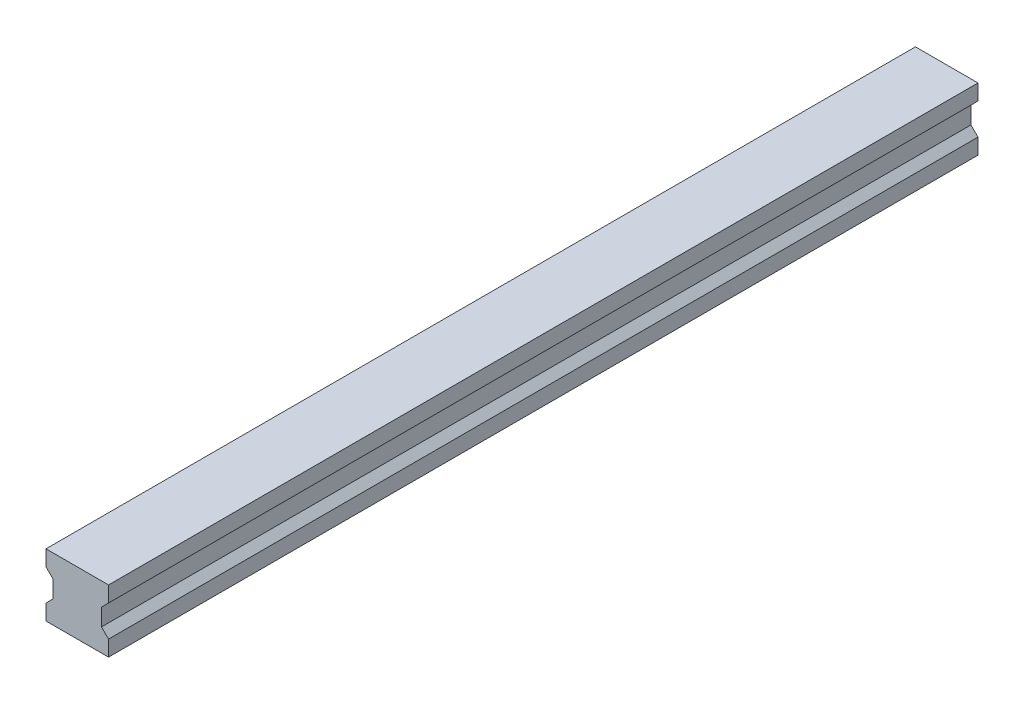
ISO-10303-21;
HEADER;
FILE_DESCRIPTION(('STEP AP214'),'2;1');
FILE_NAME('part.step','',(''),(''),'','','');
FILE_SCHEMA(('AUTOMOTIVE_DESIGN { 1 0 10303 214 1 1 1 1 }'));
ENDSEC;
DATA;
#1=APPLICATION_CONTEXT('core data for automotive mechanical design processes');
#2=APPLICATION_PROTOCOL_DEFINITION('international standard','automotive_design',2000,#1);
#3=PRODUCT_CONTEXT('',#1,'mechanical');
#4=PRODUCT('Part','Part','',(#3));
#5=PRODUCT_RELATED_PRODUCT_CATEGORY('part','',(#4));
#6=PRODUCT_DEFINITION_FORMATION('','',#4);
#7=PRODUCT_DEFINITION_CONTEXT('part definition',#1,'design');
#8=PRODUCT_DEFINITION('design','',#6,#7);
#9=PRODUCT_DEFINITION_SHAPE('','',#8);
#10=(LENGTH_UNIT() NAMED_UNIT(*) SI_UNIT(.MILLI.,.METRE.));
#11=(NAMED_UNIT(*) PLANE_ANGLE_UNIT() SI_UNIT($,.RADIAN.));
#12=(NAMED_UNIT(*) SI_UNIT($,.STERADIAN.) SOLID_ANGLE_UNIT());
#13=UNCERTAINTY_MEASURE_WITH_UNIT(LENGTH_MEASURE(1.E-05),#10,'distance_accuracy_value','');
#14=(GEOMETRIC_REPRESENTATION_CONTEXT(3) GLOBAL_UNCERTAINTY_ASSIGNED_CONTEXT((#13)) GLOBAL_UNIT_ASSIGNED_CONTEXT((#10,
#11,#12)) REPRESENTATION_CONTEXT('',''));
#15=CARTESIAN_POINT('',(0.,0.,0.));
#16=DIRECTION('',(0.,0.,1.));
#17=DIRECTION('',(1.,0.,0.));
#18=AXIS2_PLACEMENT_3D('',#15,#16,#17);
#19=CARTESIAN_POINT('',(10.,-5.,278.));
#20=DIRECTION('',(-0.707106781186552,-0.707106781186543,0.));
#21=DIRECTION('',(0.707106781186543,-0.707106781186552,0.));
#22=AXIS2_PLACEMENT_3D('',#19,#20,#21);
#23=PLANE('',#22);
#24=DIRECTION('',(-0.707106781186543,0.707106781186552,0.));
#25=VECTOR('',#24,1.);
#26=CARTESIAN_POINT('',(10.,-5.,0.));
#27=LINE('',#26,#25);
#28=CARTESIAN_POINT('',(10.,-5.,0.));
#29=VERTEX_POINT('',#28);
#30=CARTESIAN_POINT('',(7.75000000000003,-2.75,0.));
#31=VERTEX_POINT('',#30);
#32=EDGE_CURVE('E153',#29,#31,#27,.T.);
#33=ORIENTED_EDGE('',*,*,#32,.T.);
#34=DIRECTION('',(0.,0.,-1.));
#35=VECTOR('',#34,1.);
#36=CARTESIAN_POINT('',(7.75000000000003,-2.75,278.));
#37=LINE('',#36,#35);
#38=CARTESIAN_POINT('',(7.75000000000003,-2.75,278.));
#39=VERTEX_POINT('',#38);
#40=EDGE_CURVE('E11',#39,#31,#37,.T.);
#41=ORIENTED_EDGE('',*,*,#40,.F.);
#42=DIRECTION('',(-0.707106781186543,0.707106781186552,0.));
#43=VECTOR('',#42,1.);
#44=CARTESIAN_POINT('',(10.,-5.,278.));
#45=LINE('',#44,#43);
#46=CARTESIAN_POINT('',(10.,-5.,278.));
#47=VERTEX_POINT('',#46);
#48=EDGE_CURVE('E175',#47,#39,#45,.T.);
#49=ORIENTED_EDGE('',*,*,#48,.F.);
#50=DIRECTION('',(0.,0.,-1.));
#51=VECTOR('',#50,1.);
#52=CARTESIAN_POINT('',(10.,-5.,278.));
#53=LINE('',#52,#51);
#54=EDGE_CURVE('E149',#47,#29,#53,.T.);
#55=ORIENTED_EDGE('',*,*,#54,.T.);
#56=EDGE_LOOP('',(#33,#41,#49,#55));
#57=FACE_BOUND('',#56,.T.);
#58=ADVANCED_FACE('F33',(#57),#23,.F.);
#59=CARTESIAN_POINT('',(7.75000000000003,-2.75,278.));
#60=DIRECTION('',(-1.,0.,0.));
#61=DIRECTION('',(0.,0.,1.));
#62=AXIS2_PLACEMENT_3D('',#59,#60,#61);
#63=PLANE('',#62);
#64=DIRECTION('',(0.,1.,0.));
#65=VECTOR('',#64,1.);
#66=CARTESIAN_POINT('',(7.75000000000003,-2.75,0.));
#67=LINE('',#66,#65);
#68=CARTESIAN_POINT('',(7.75000000000003,2.75,0.));
#69=VERTEX_POINT('',#68);
#70=EDGE_CURVE('E156',#31,#69,#67,.T.);
#71=ORIENTED_EDGE('',*,*,#70,.T.);
#72=DIRECTION('',(0.,0.,-1.));
#73=VECTOR('',#72,1.);
#74=CARTESIAN_POINT('',(7.75000000000003,2.75,278.));
#75=LINE('',#74,#73);
#76=CARTESIAN_POINT('',(7.75000000000003,2.75,278.));
#77=VERTEX_POINT('',#76);
#78=EDGE_CURVE('E41',#77,#69,#75,.T.);
#79=ORIENTED_EDGE('',*,*,#78,.F.);
#80=DIRECTION('',(0.,1.,0.));
#81=VECTOR('',#80,1.);
#82=CARTESIAN_POINT('',(7.75000000000003,-2.75,278.));
#83=LINE('',#82,#81);
#84=EDGE_CURVE('E104',#39,#77,#83,.T.);
#85=ORIENTED_EDGE('',*,*,#84,.F.);
#86=ORIENTED_EDGE('',*,*,#40,.T.);
#87=EDGE_LOOP('',(#71,#79,#85,#86));
#88=FACE_BOUND('',#87,.T.);
#89=ADVANCED_FACE('F253',(#88),#63,.F.);
#90=CARTESIAN_POINT('',(7.75000000000003,2.75,278.));
#91=DIRECTION('',(-0.707106781186552,0.707106781186543,0.));
#92=DIRECTION('',(-0.707106781186543,-0.707106781186552,0.));
#93=AXIS2_PLACEMENT_3D('',#90,#91,#92);
#94=PLANE('',#93);
#95=DIRECTION('',(0.707106781186543,0.707106781186552,0.));
#96=VECTOR('',#95,1.);
#97=CARTESIAN_POINT('',(7.75000000000003,2.75,0.));
#98=LINE('',#97,#96);
#99=CARTESIAN_POINT('',(10.,5.,0.));
#100=VERTEX_POINT('',#99);
#101=EDGE_CURVE('E158',#69,#100,#98,.T.);
#102=ORIENTED_EDGE('',*,*,#101,.T.);
#103=DIRECTION('',(0.,0.,-1.));
#104=VECTOR('',#103,1.);
#105=CARTESIAN_POINT('',(10.,5.,278.));
#106=LINE('',#105,#104);
#107=CARTESIAN_POINT('',(10.,5.,278.));
#108=VERTEX_POINT('',#107);
#109=EDGE_CURVE('E194',#108,#100,#106,.T.);
#110=ORIENTED_EDGE('',*,*,#109,.F.);
#111=DIRECTION('',(0.707106781186543,0.707106781186552,0.));
#112=VECTOR('',#111,1.);
#113=CARTESIAN_POINT('',(7.75000000000003,2.75,278.));
#114=LINE('',#113,#112);
#115=EDGE_CURVE('E202',#77,#108,#114,.T.);
#116=ORIENTED_EDGE('',*,*,#115,.F.);
#117=ORIENTED_EDGE('',*,*,#78,.T.);
#118=EDGE_LOOP('',(#102,#110,#116,#117));
#119=FACE_BOUND('',#118,.T.);
#120=ADVANCED_FACE('F200',(#119),#94,.F.);
#121=CARTESIAN_POINT('',(10.,5.,278.));
#122=DIRECTION('',(-1.,0.,0.));
#123=DIRECTION('',(0.,0.,1.));
#124=AXIS2_PLACEMENT_3D('',#121,#122,#123);
#125=PLANE('',#124);
#126=DIRECTION('',(0.,1.,0.));
#127=VECTOR('',#126,1.);
#128=CARTESIAN_POINT('',(10.,5.,0.));
#129=LINE('',#128,#127);
#130=CARTESIAN_POINT('',(10.,9.99999999999999,0.));
#131=VERTEX_POINT('',#130);
#132=EDGE_CURVE('E160',#100,#131,#129,.T.);
#133=ORIENTED_EDGE('',*,*,#132,.T.);
#134=DIRECTION('',(0.,0.,-1.));
#135=VECTOR('',#134,1.);
#136=CARTESIAN_POINT('',(10.,9.99999999999999,278.));
#137=LINE('',#136,#135);
#138=CARTESIAN_POINT('',(10.,9.99999999999999,278.));
#139=VERTEX_POINT('',#138);
#140=EDGE_CURVE('E191',#139,#131,#137,.T.);
#141=ORIENTED_EDGE('',*,*,#140,.F.);
#142=DIRECTION('',(0.,1.,0.));
#143=VECTOR('',#142,1.);
#144=CARTESIAN_POINT('',(10.,5.,278.));
#145=LINE('',#144,#143);
#146=EDGE_CURVE('E220',#108,#139,#145,.T.);
#147=ORIENTED_EDGE('',*,*,#146,.F.);
#148=ORIENTED_EDGE('',*,*,#109,.T.);
#149=EDGE_LOOP('',(#133,#141,#147,#148));
#150=FACE_BOUND('',#149,.T.);
#151=ADVANCED_FACE('F211',(#150),#125,.F.);
#152=CARTESIAN_POINT('',(10.,9.99999999999999,278.));
#153=DIRECTION('',(0.,-1.,0.));
#154=DIRECTION('',(0.,0.,-1.));
#155=AXIS2_PLACEMENT_3D('',#152,#153,#154);
#156=PLANE('',#155);
#157=DIRECTION('',(-1.,0.,0.));
#158=VECTOR('',#157,1.);
#159=CARTESIAN_POINT('',(10.,9.99999999999999,0.));
#160=LINE('',#159,#158);
#161=CARTESIAN_POINT('',(-10.,9.99999999999999,0.));
#162=VERTEX_POINT('',#161);
#163=EDGE_CURVE('E162',#131,#162,#160,.T.);
#164=ORIENTED_EDGE('',*,*,#163,.T.);
#165=DIRECTION('',(0.,0.,-1.));
#166=VECTOR('',#165,1.);
#167=CARTESIAN_POINT('',(-10.,9.99999999999999,278.));
#168=LINE('',#167,#166);
#169=CARTESIAN_POINT('',(-10.,9.99999999999999,278.));
#170=VERTEX_POINT('',#169);
#171=EDGE_CURVE('E188',#170,#162,#168,.T.);
#172=ORIENTED_EDGE('',*,*,#171,.F.);
#173=DIRECTION('',(-1.,0.,0.));
#174=VECTOR('',#173,1.);
#175=CARTESIAN_POINT('',(10.,9.99999999999999,278.));
#176=LINE('',#175,#174);
#177=EDGE_CURVE('E217',#139,#170,#176,.T.);
#178=ORIENTED_EDGE('',*,*,#177,.F.);
#179=ORIENTED_EDGE('',*,*,#140,.T.);
#180=EDGE_LOOP('',(#164,#172,#178,#179));
#181=FACE_BOUND('',#180,.T.);
#182=ADVANCED_FACE('F215',(#181),#156,.F.);
#183=CARTESIAN_POINT('',(-10.,9.99999999999999,278.));
#184=DIRECTION('',(1.,0.,0.));
#185=DIRECTION('',(0.,0.,-1.));
#186=AXIS2_PLACEMENT_3D('',#183,#184,#185);
#187=PLANE('',#186);
#188=DIRECTION('',(0.,-1.,0.));
#189=VECTOR('',#188,1.);
#190=CARTESIAN_POINT('',(-10.,9.99999999999999,0.));
#191=LINE('',#190,#189);
#192=CARTESIAN_POINT('',(-10.,4.9999991059303,0.));
#193=VERTEX_POINT('',#192);
#194=EDGE_CURVE('E164',#162,#193,#191,.T.);
#195=ORIENTED_EDGE('',*,*,#194,.T.);
#196=DIRECTION('',(0.,0.,-1.));
#197=VECTOR('',#196,1.);
#198=CARTESIAN_POINT('',(-10.,4.9999991059303,278.));
#199=LINE('',#198,#197);
#200=CARTESIAN_POINT('',(-10.,4.9999991059303,278.));
#201=VERTEX_POINT('',#200);
#202=EDGE_CURVE('E185',#201,#193,#199,.T.);
#203=ORIENTED_EDGE('',*,*,#202,.F.);
#204=DIRECTION('',(0.,-1.,0.));
#205=VECTOR('',#204,1.);
#206=CARTESIAN_POINT('',(-10.,9.99999999999999,278.));
#207=LINE('',#206,#205);
#208=EDGE_CURVE('E219',#170,#201,#207,.T.);
#209=ORIENTED_EDGE('',*,*,#208,.F.);
#210=ORIENTED_EDGE('',*,*,#171,.T.);
#211=EDGE_LOOP('',(#195,#203,#209,#210));
#212=FACE_BOUND('',#211,.T.);
#213=ADVANCED_FACE('F266',(#212),#187,.F.);
#214=CARTESIAN_POINT('',(-10.,4.9999991059303,278.));
#215=DIRECTION('',(0.707107502366376,0.707106060005984,0.));
#216=DIRECTION('',(-0.707106060005984,0.707107502366376,0.));
#217=AXIS2_PLACEMENT_3D('',#214,#215,#216);
#218=PLANE('',#217);
#219=DIRECTION('',(0.707106060005984,-0.707107502366376,0.));
#220=VECTOR('',#219,1.);
#221=CARTESIAN_POINT('',(-10.,4.9999991059303,0.));
#222=LINE('',#221,#220);
#223=CARTESIAN_POINT('',(-7.75000458955799,2.7499991059303,0.));
#224=VERTEX_POINT('',#223);
#225=EDGE_CURVE('E166',#193,#224,#222,.T.);
#226=ORIENTED_EDGE('',*,*,#225,.T.);
#227=DIRECTION('',(0.,0.,-1.));
#228=VECTOR('',#227,1.);
#229=CARTESIAN_POINT('',(-7.75000458955799,2.7499991059303,278.));
#230=LINE('',#229,#228);
#231=CARTESIAN_POINT('',(-7.75000458955799,2.7499991059303,278.));
#232=VERTEX_POINT('',#231);
#233=EDGE_CURVE('E182',#232,#224,#230,.T.);
#234=ORIENTED_EDGE('',*,*,#233,.F.);
#235=DIRECTION('',(0.707106060005984,-0.707107502366376,0.));
#236=VECTOR('',#235,1.);
#237=CARTESIAN_POINT('',(-10.,4.9999991059303,278.));
#238=LINE('',#237,#236);
#239=EDGE_CURVE('E222',#201,#232,#238,.T.);
#240=ORIENTED_EDGE('',*,*,#239,.F.);
#241=ORIENTED_EDGE('',*,*,#202,.T.);
#242=EDGE_LOOP('',(#226,#234,#240,#241));
#243=FACE_BOUND('',#242,.T.);
#244=ADVANCED_FACE('F269',(#243),#218,.F.);
#245=CARTESIAN_POINT('',(-7.75000458955799,2.7499991059303,278.));
#246=DIRECTION('',(1.,0.,0.));
#247=DIRECTION('',(0.,0.,-1.));
#248=AXIS2_PLACEMENT_3D('',#245,#246,#247);
#249=PLANE('',#248);
#250=DIRECTION('',(0.,-1.,0.));
#251=VECTOR('',#250,1.);
#252=CARTESIAN_POINT('',(-7.75000458955799,2.7499991059303,0.));
#253=LINE('',#252,#251);
#254=CARTESIAN_POINT('',(-7.75000458955799,-2.7499991059303,0.));
#255=VERTEX_POINT('',#254);
#256=EDGE_CURVE('E168',#224,#255,#253,.T.);
#257=ORIENTED_EDGE('',*,*,#256,.T.);
#258=DIRECTION('',(0.,0.,-1.));
#259=VECTOR('',#258,1.);
#260=CARTESIAN_POINT('',(-7.75000458955799,-2.7499991059303,278.));
#261=LINE('',#260,#259);
#262=CARTESIAN_POINT('',(-7.75000458955799,-2.7499991059303,278.));
#263=VERTEX_POINT('',#262);
#264=EDGE_CURVE('E179',#263,#255,#261,.T.);
#265=ORIENTED_EDGE('',*,*,#264,.F.);
#266=DIRECTION('',(0.,-1.,0.));
#267=VECTOR('',#266,1.);
#268=CARTESIAN_POINT('',(-7.75000458955799,2.7499991059303,278.));
#269=LINE('',#268,#267);
#270=EDGE_CURVE('E228',#232,#263,#269,.T.);
#271=ORIENTED_EDGE('',*,*,#270,.F.);
#272=ORIENTED_EDGE('',*,*,#233,.T.);
#273=EDGE_LOOP('',(#257,#265,#271,#272));
#274=FACE_BOUND('',#273,.T.);
#275=ADVANCED_FACE('F234',(#274),#249,.F.);
#276=CARTESIAN_POINT('',(-7.75000458955799,-2.7499991059303,278.));
#277=DIRECTION('',(0.707107502366375,-0.707106060005985,0.));
#278=DIRECTION('',(0.707106060005985,0.707107502366375,0.));
#279=AXIS2_PLACEMENT_3D('',#276,#277,#278);
#280=PLANE('',#279);
#281=DIRECTION('',(-0.707106060005985,-0.707107502366375,0.));
#282=VECTOR('',#281,1.);
#283=CARTESIAN_POINT('',(-7.75000458955799,-2.7499991059303,0.));
#284=LINE('',#283,#282);
#285=CARTESIAN_POINT('',(-10.,-4.9999991059303,0.));
#286=VERTEX_POINT('',#285);
#287=EDGE_CURVE('E170',#255,#286,#284,.T.);
#288=ORIENTED_EDGE('',*,*,#287,.T.);
#289=DIRECTION('',(0.,0.,-1.));
#290=VECTOR('',#289,1.);
#291=CARTESIAN_POINT('',(-10.,-4.9999991059303,278.));
#292=LINE('',#291,#290);
#293=CARTESIAN_POINT('',(-10.,-4.9999991059303,278.));
#294=VERTEX_POINT('',#293);
#295=EDGE_CURVE('E144',#294,#286,#292,.T.);
#296=ORIENTED_EDGE('',*,*,#295,.F.);
#297=DIRECTION('',(-0.707106060005985,-0.707107502366375,0.));
#298=VECTOR('',#297,1.);
#299=CARTESIAN_POINT('',(-7.75000458955799,-2.7499991059303,278.));
#300=LINE('',#299,#298);
#301=EDGE_CURVE('E135',#263,#294,#300,.T.);
#302=ORIENTED_EDGE('',*,*,#301,.F.);
#303=ORIENTED_EDGE('',*,*,#264,.T.);
#304=EDGE_LOOP('',(#288,#296,#302,#303));
#305=FACE_BOUND('',#304,.T.);
#306=ADVANCED_FACE('F238',(#305),#280,.F.);
#307=CARTESIAN_POINT('',(-10.,-4.9999991059303,278.));
#308=DIRECTION('',(1.,0.,0.));
#309=DIRECTION('',(0.,0.,-1.));
#310=AXIS2_PLACEMENT_3D('',#307,#308,#309);
#311=PLANE('',#310);
#312=DIRECTION('',(0.,-1.,0.));
#313=VECTOR('',#312,1.);
#314=CARTESIAN_POINT('',(-10.,-4.9999991059303,0.));
#315=LINE('',#314,#313);
#316=CARTESIAN_POINT('',(-10.,-10.,0.));
#317=VERTEX_POINT('',#316);
#318=EDGE_CURVE('E143',#286,#317,#315,.T.);
#319=ORIENTED_EDGE('',*,*,#318,.T.);
#320=DIRECTION('',(0.,0.,-1.));
#321=VECTOR('',#320,1.);
#322=CARTESIAN_POINT('',(-10.,-10.,278.));
#323=LINE('',#322,#321);
#324=CARTESIAN_POINT('',(-10.,-10.,278.));
#325=VERTEX_POINT('',#324);
#326=EDGE_CURVE('E140',#325,#317,#323,.T.);
#327=ORIENTED_EDGE('',*,*,#326,.F.);
#328=DIRECTION('',(0.,-1.,0.));
#329=VECTOR('',#328,1.);
#330=CARTESIAN_POINT('',(-10.,-4.9999991059303,278.));
#331=LINE('',#330,#329);
#332=EDGE_CURVE('E129',#294,#325,#331,.T.);
#333=ORIENTED_EDGE('',*,*,#332,.F.);
#334=ORIENTED_EDGE('',*,*,#295,.T.);
#335=EDGE_LOOP('',(#319,#327,#333,#334));
#336=FACE_BOUND('',#335,.T.);
#337=ADVANCED_FACE('F141',(#336),#311,.F.);
#338=CARTESIAN_POINT('',(-10.,-10.,278.));
#339=DIRECTION('',(0.,1.,0.));
#340=DIRECTION('',(0.,0.,1.));
#341=AXIS2_PLACEMENT_3D('',#338,#339,#340);
#342=PLANE('',#341);
#343=DIRECTION('',(1.,0.,0.));
#344=VECTOR('',#343,1.);
#345=CARTESIAN_POINT('',(-10.,-10.,0.));
#346=LINE('',#345,#344);
#347=CARTESIAN_POINT('',(10.,-10.,0.));
#348=VERTEX_POINT('',#347);
#349=EDGE_CURVE('E90',#317,#348,#346,.T.);
#350=ORIENTED_EDGE('',*,*,#349,.T.);
#351=DIRECTION('',(0.,0.,-1.));
#352=VECTOR('',#351,1.);
#353=CARTESIAN_POINT('',(10.,-10.,278.));
#354=LINE('',#353,#352);
#355=CARTESIAN_POINT('',(10.,-10.,278.));
#356=VERTEX_POINT('',#355);
#357=EDGE_CURVE('E145',#356,#348,#354,.T.);
#358=ORIENTED_EDGE('',*,*,#357,.F.);
#359=DIRECTION('',(1.,0.,0.));
#360=VECTOR('',#359,1.);
#361=CARTESIAN_POINT('',(-10.,-10.,278.));
#362=LINE('',#361,#360);
#363=EDGE_CURVE('E133',#325,#356,#362,.T.);
#364=ORIENTED_EDGE('',*,*,#363,.F.);
#365=ORIENTED_EDGE('',*,*,#326,.T.);
#366=EDGE_LOOP('',(#350,#358,#364,#365));
#367=FACE_BOUND('',#366,.T.);
#368=ADVANCED_FACE('F147',(#367),#342,.F.);
#369=CARTESIAN_POINT('',(10.,-10.,278.));
#370=DIRECTION('',(-1.,0.,0.));
#371=DIRECTION('',(0.,0.,1.));
#372=AXIS2_PLACEMENT_3D('',#369,#370,#371);
#373=PLANE('',#372);
#374=DIRECTION('',(0.,1.,0.));
#375=VECTOR('',#374,1.);
#376=CARTESIAN_POINT('',(10.,-10.,0.));
#377=LINE('',#376,#375);
#378=EDGE_CURVE('E96',#348,#29,#377,.T.);
#379=ORIENTED_EDGE('',*,*,#378,.T.);
#380=ORIENTED_EDGE('',*,*,#54,.F.);
#381=DIRECTION('',(0.,1.,0.));
#382=VECTOR('',#381,1.);
#383=CARTESIAN_POINT('',(10.,-10.,278.));
#384=LINE('',#383,#382);
#385=EDGE_CURVE('E49',#356,#47,#384,.T.);
#386=ORIENTED_EDGE('',*,*,#385,.F.);
#387=ORIENTED_EDGE('',*,*,#357,.T.);
#388=EDGE_LOOP('',(#379,#380,#386,#387));
#389=FACE_BOUND('',#388,.T.);
#390=ADVANCED_FACE('F242',(#389),#373,.F.);
#391=CARTESIAN_POINT('',(0.,0.,278.));
#392=DIRECTION('',(0.,0.,-1.));
#393=DIRECTION('',(-1.,0.,0.));
#394=AXIS2_PLACEMENT_3D('',#391,#392,#393);
#395=PLANE('',#394);
#396=ORIENTED_EDGE('',*,*,#48,.T.);
#397=ORIENTED_EDGE('',*,*,#84,.T.);
#398=ORIENTED_EDGE('',*,*,#115,.T.);
#399=ORIENTED_EDGE('',*,*,#146,.T.);
#400=ORIENTED_EDGE('',*,*,#177,.T.);
#401=ORIENTED_EDGE('',*,*,#208,.T.);
#402=ORIENTED_EDGE('',*,*,#239,.T.);
#403=ORIENTED_EDGE('',*,*,#270,.T.);
#404=ORIENTED_EDGE('',*,*,#301,.T.);
#405=ORIENTED_EDGE('',*,*,#332,.T.);
#406=ORIENTED_EDGE('',*,*,#363,.T.);
#407=ORIENTED_EDGE('',*,*,#385,.T.);
#408=EDGE_LOOP('',(#396,#397,#398,#399,#400,#401,#402,#403,#404,#405,#406,#407));
#409=FACE_BOUND('',#408,.T.);
#410=ADVANCED_FACE('F131',(#409),#395,.F.);
#411=CARTESIAN_POINT('',(0.,0.,0.));
#412=DIRECTION('',(0.,0.,-1.));
#413=DIRECTION('',(-1.,0.,0.));
#414=AXIS2_PLACEMENT_3D('',#411,#412,#413);
#415=PLANE('',#414);
#416=ORIENTED_EDGE('',*,*,#32,.F.);
#417=ORIENTED_EDGE('',*,*,#378,.F.);
#418=ORIENTED_EDGE('',*,*,#349,.F.);
#419=ORIENTED_EDGE('',*,*,#318,.F.);
#420=ORIENTED_EDGE('',*,*,#287,.F.);
#421=ORIENTED_EDGE('',*,*,#256,.F.);
#422=ORIENTED_EDGE('',*,*,#225,.F.);
#423=ORIENTED_EDGE('',*,*,#194,.F.);
#424=ORIENTED_EDGE('',*,*,#163,.F.);
#425=ORIENTED_EDGE('',*,*,#132,.F.);
#426=ORIENTED_EDGE('',*,*,#101,.F.);
#427=ORIENTED_EDGE('',*,*,#70,.F.);
#428=EDGE_LOOP('',(#416,#417,#418,#419,#420,#421,#422,#423,#424,#425,#426,#427));
#429=FACE_BOUND('',#428,.T.);
#430=ADVANCED_FACE('F206',(#429),#415,.T.);
#431=CLOSED_SHELL('',(#58,#89,#120,#151,#182,#213,#244,#275,#306,#337,#368,#390,#410,#430));
#432=MANIFOLD_SOLID_BREP('B2',#431);
#433=ADVANCED_BREP_SHAPE_REPRESENTATION('',(#18,#432),#14);
#434=SHAPE_DEFINITION_REPRESENTATION(#9,#433);
ENDSEC;
END-ISO-10303-21;
